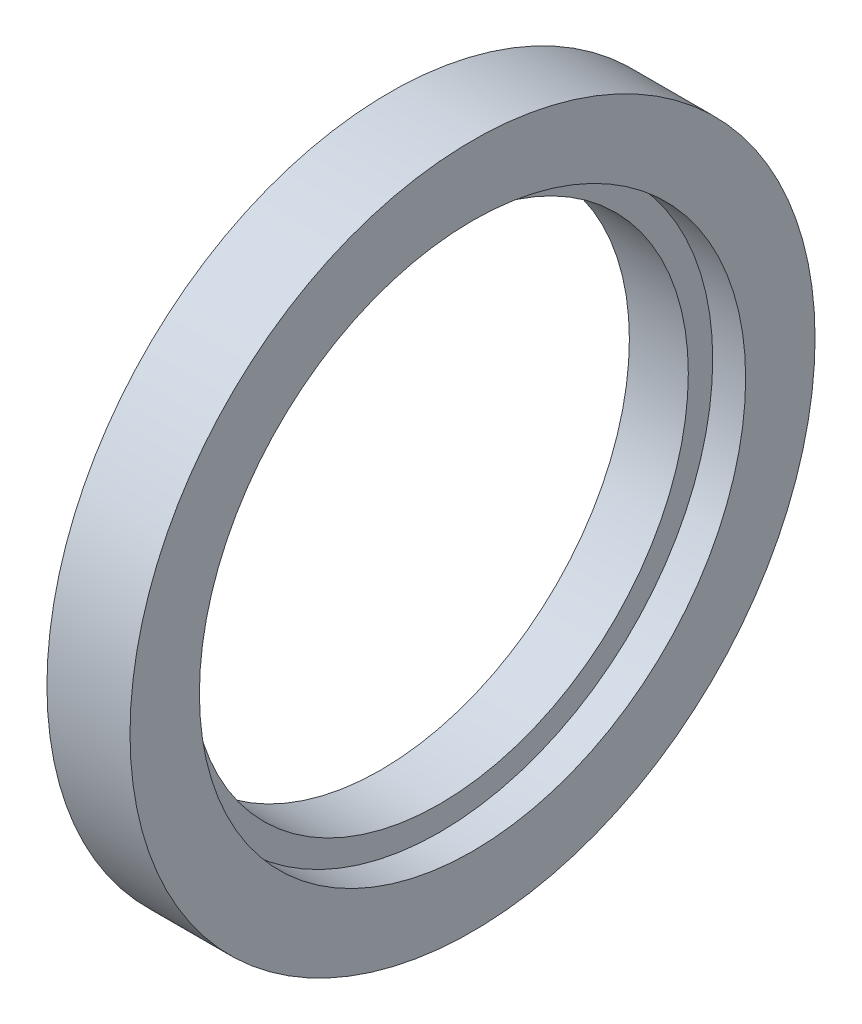
ISO-10303-21;
HEADER;
FILE_DESCRIPTION(('STEP AP214'),'2;1');
FILE_NAME('part.step','',(''),(''),'','','');
FILE_SCHEMA(('AUTOMOTIVE_DESIGN { 1 0 10303 214 1 1 1 1 }'));
ENDSEC;
DATA;
#1=APPLICATION_CONTEXT('core data for automotive mechanical design processes');
#2=APPLICATION_PROTOCOL_DEFINITION('international standard','automotive_design',2000,#1);
#3=PRODUCT_CONTEXT('',#1,'mechanical');
#4=PRODUCT('Part','Part','',(#3));
#5=PRODUCT_RELATED_PRODUCT_CATEGORY('part','',(#4));
#6=PRODUCT_DEFINITION_FORMATION('','',#4);
#7=PRODUCT_DEFINITION_CONTEXT('part definition',#1,'design');
#8=PRODUCT_DEFINITION('design','',#6,#7);
#9=PRODUCT_DEFINITION_SHAPE('','',#8);
#10=(LENGTH_UNIT() NAMED_UNIT(*) SI_UNIT(.MILLI.,.METRE.));
#11=(NAMED_UNIT(*) PLANE_ANGLE_UNIT() SI_UNIT($,.RADIAN.));
#12=(NAMED_UNIT(*) SI_UNIT($,.STERADIAN.) SOLID_ANGLE_UNIT());
#13=UNCERTAINTY_MEASURE_WITH_UNIT(LENGTH_MEASURE(1.E-05),#10,'distance_accuracy_value','');
#14=(GEOMETRIC_REPRESENTATION_CONTEXT(3) GLOBAL_UNCERTAINTY_ASSIGNED_CONTEXT((#13)) GLOBAL_UNIT_ASSIGNED_CONTEXT((#10,
#11,#12)) REPRESENTATION_CONTEXT('',''));
#15=CARTESIAN_POINT('',(0.,0.,0.));
#16=DIRECTION('',(0.,0.,1.));
#17=DIRECTION('',(1.,0.,0.));
#18=AXIS2_PLACEMENT_3D('',#15,#16,#17);
#19=CARTESIAN_POINT('',(2.0692999999999,0.,0.));
#20=DIRECTION('',(1.,0.,0.));
#21=DIRECTION('',(0.,0.,-1.));
#22=AXIS2_PLACEMENT_3D('',#19,#20,#21);
#23=CYLINDRICAL_SURFACE('',#22,17.4624999999999);
#24=CARTESIAN_POINT('',(4.13859999999983,0.,0.));
#25=DIRECTION('',(1.,0.,0.));
#26=DIRECTION('',(0.,0.,-1.));
#27=AXIS2_PLACEMENT_3D('',#24,#25,#26);
#28=CIRCLE('',#27,17.4624999999999);
#29=CARTESIAN_POINT('',(4.13859999999983,0.,-17.4624999999999));
#30=VERTEX_POINT('',#29);
#31=EDGE_CURVE('E16',#30,#30,#28,.F.);
#32=ORIENTED_EDGE('',*,*,#31,.F.);
#33=EDGE_LOOP('',(#32));
#34=FACE_BOUND('',#33,.T.);
#35=CARTESIAN_POINT('',(0.,0.,0.));
#36=DIRECTION('',(1.,0.,0.));
#37=DIRECTION('',(0.,0.,-1.));
#38=AXIS2_PLACEMENT_3D('',#35,#36,#37);
#39=CIRCLE('',#38,17.4624999999999);
#40=CARTESIAN_POINT('',(0.,0.,-17.4624999999999));
#41=VERTEX_POINT('',#40);
#42=EDGE_CURVE('E42',#41,#41,#39,.T.);
#43=ORIENTED_EDGE('',*,*,#42,.F.);
#44=EDGE_LOOP('',(#43));
#45=FACE_BOUND('',#44,.T.);
#46=ADVANCED_FACE('F13',(#34,#45),#23,.F.);
#47=CARTESIAN_POINT('',(4.13859999999983,18.3197499999999,0.));
#48=DIRECTION('',(1.,0.,0.));
#49=DIRECTION('',(0.,0.,-1.));
#50=AXIS2_PLACEMENT_3D('',#47,#48,#49);
#51=PLANE('',#50);
#52=ORIENTED_EDGE('',*,*,#31,.T.);
#53=EDGE_LOOP('',(#52));
#54=FACE_BOUND('',#53,.T.);
#55=CARTESIAN_POINT('',(4.13859999999983,0.,0.));
#56=DIRECTION('',(1.,0.,0.));
#57=DIRECTION('',(0.,0.,-1.));
#58=AXIS2_PLACEMENT_3D('',#55,#56,#57);
#59=CIRCLE('',#58,19.1769999999999);
#60=CARTESIAN_POINT('',(4.13859999999983,0.,-19.1769999999999));
#61=VERTEX_POINT('',#60);
#62=EDGE_CURVE('E40',#61,#61,#59,.T.);
#63=ORIENTED_EDGE('',*,*,#62,.T.);
#64=EDGE_LOOP('',(#63));
#65=FACE_BOUND('',#64,.T.);
#66=ADVANCED_FACE('F49',(#54,#65),#51,.T.);
#67=CARTESIAN_POINT('',(0.,19.2062500000005,0.));
#68=DIRECTION('',(-1.,0.,0.));
#69=DIRECTION('',(0.,0.,1.));
#70=AXIS2_PLACEMENT_3D('',#67,#68,#69);
#71=PLANE('',#70);
#72=ORIENTED_EDGE('',*,*,#42,.T.);
#73=EDGE_LOOP('',(#72));
#74=FACE_BOUND('',#73,.T.);
#75=CARTESIAN_POINT('',(0.,0.,0.));
#76=DIRECTION('',(1.,0.,0.));
#77=DIRECTION('',(0.,0.,-1.));
#78=AXIS2_PLACEMENT_3D('',#75,#76,#77);
#79=CIRCLE('',#78,20.950000000001);
#80=CARTESIAN_POINT('',(0.,0.,-20.950000000001));
#81=VERTEX_POINT('',#80);
#82=EDGE_CURVE('E37',#81,#81,#79,.F.);
#83=ORIENTED_EDGE('',*,*,#82,.T.);
#84=EDGE_LOOP('',(#83));
#85=FACE_BOUND('',#84,.T.);
#86=ADVANCED_FACE('F60',(#74,#85),#71,.T.);
#87=CARTESIAN_POINT('',(5.29429999999922,0.,0.));
#88=DIRECTION('',(1.,0.,0.));
#89=DIRECTION('',(0.,0.,-1.));
#90=AXIS2_PLACEMENT_3D('',#87,#88,#89);
#91=CYLINDRICAL_SURFACE('',#90,19.1769999999999);
#92=CARTESIAN_POINT('',(6.44999999999861,0.,0.));
#93=DIRECTION('',(1.,0.,0.));
#94=DIRECTION('',(0.,0.,-1.));
#95=AXIS2_PLACEMENT_3D('',#92,#93,#94);
#96=CIRCLE('',#95,19.1769999999999);
#97=CARTESIAN_POINT('',(6.44999999999861,0.,-19.1769999999999));
#98=VERTEX_POINT('',#97);
#99=EDGE_CURVE('E32',#98,#98,#96,.F.);
#100=ORIENTED_EDGE('',*,*,#99,.F.);
#101=EDGE_LOOP('',(#100));
#102=FACE_BOUND('',#101,.T.);
#103=ORIENTED_EDGE('',*,*,#62,.F.);
#104=EDGE_LOOP('',(#103));
#105=FACE_BOUND('',#104,.T.);
#106=ADVANCED_FACE('F79',(#102,#105),#91,.F.);
#107=CARTESIAN_POINT('',(-0.255000000000098,0.,0.));
#108=DIRECTION('',(1.,0.,0.));
#109=DIRECTION('',(0.,0.,-1.));
#110=AXIS2_PLACEMENT_3D('',#107,#108,#109);
#111=CYLINDRICAL_SURFACE('',#110,20.950000000001);
#112=ORIENTED_EDGE('',*,*,#82,.F.);
#113=EDGE_LOOP('',(#112));
#114=FACE_BOUND('',#113,.T.);
#115=CARTESIAN_POINT('',(-0.510000002164026,0.,0.));
#116=DIRECTION('',(1.,0.,0.));
#117=DIRECTION('',(0.,1.,0.));
#118=AXIS2_PLACEMENT_3D('',#115,#116,#117);
#119=CIRCLE('',#118,20.9500000007886);
#120=CARTESIAN_POINT('',(-0.510000002164026,20.9500000007886,0.));
#121=VERTEX_POINT('',#120);
#122=EDGE_CURVE('E25',#121,#121,#119,.T.);
#123=ORIENTED_EDGE('',*,*,#122,.F.);
#124=EDGE_LOOP('',(#123));
#125=FACE_BOUND('',#124,.T.);
#126=ADVANCED_FACE('F75',(#114,#125),#111,.F.);
#127=CARTESIAN_POINT('',(6.44999999999861,21.6135000000001,0.));
#128=DIRECTION('',(1.,0.,0.));
#129=DIRECTION('',(0.,0.,-1.));
#130=AXIS2_PLACEMENT_3D('',#127,#128,#129);
#131=PLANE('',#130);
#132=ORIENTED_EDGE('',*,*,#99,.T.);
#133=EDGE_LOOP('',(#132));
#134=FACE_BOUND('',#133,.T.);
#135=CARTESIAN_POINT('',(6.44999999999861,0.,0.));
#136=DIRECTION('',(1.,0.,0.));
#137=DIRECTION('',(0.,0.,-1.));
#138=AXIS2_PLACEMENT_3D('',#135,#136,#137);
#139=CIRCLE('',#138,24.0500000000003);
#140=CARTESIAN_POINT('',(6.44999999999861,0.,-24.0500000000003));
#141=VERTEX_POINT('',#140);
#142=EDGE_CURVE('E20',#141,#141,#139,.F.);
#143=ORIENTED_EDGE('',*,*,#142,.F.);
#144=EDGE_LOOP('',(#143));
#145=FACE_BOUND('',#144,.T.);
#146=ADVANCED_FACE('F68',(#134,#145),#131,.T.);
#147=CARTESIAN_POINT('',(0.618307728388946,0.,0.));
#148=DIRECTION('',(1.,0.,0.));
#149=DIRECTION('',(0.,0.,-1.));
#150=AXIS2_PLACEMENT_3D('',#147,#148,#149);
#151=CONICAL_SURFACE('',#150,24.0499999992128,1.22173047499991);
#152=ORIENTED_EDGE('',*,*,#122,.T.);
#153=EDGE_LOOP('',(#152));
#154=FACE_BOUND('',#153,.T.);
#155=CARTESIAN_POINT('',(0.618307726225102,0.,0.));
#156=DIRECTION('',(1.,0.,0.));
#157=DIRECTION('',(0.,0.,-1.));
#158=AXIS2_PLACEMENT_3D('',#155,#156,#157);
#159=CIRCLE('',#158,24.0500000000003);
#160=CARTESIAN_POINT('',(0.618307726225102,0.,-24.0500000000003));
#161=VERTEX_POINT('',#160);
#162=EDGE_CURVE('E9',#161,#161,#159,.T.);
#163=ORIENTED_EDGE('',*,*,#162,.F.);
#164=EDGE_LOOP('',(#163));
#165=FACE_BOUND('',#164,.T.);
#166=ADVANCED_FACE('F62',(#154,#165),#151,.T.);
#167=CARTESIAN_POINT('',(3.53415386311184,0.,0.));
#168=DIRECTION('',(1.,0.,0.));
#169=DIRECTION('',(0.,0.,-1.));
#170=AXIS2_PLACEMENT_3D('',#167,#168,#169);
#171=CYLINDRICAL_SURFACE('',#170,24.0500000000003);
#172=ORIENTED_EDGE('',*,*,#162,.T.);
#173=EDGE_LOOP('',(#172));
#174=FACE_BOUND('',#173,.T.);
#175=ORIENTED_EDGE('',*,*,#142,.T.);
#176=EDGE_LOOP('',(#175));
#177=FACE_BOUND('',#176,.T.);
#178=ADVANCED_FACE('F61',(#174,#177),#171,.T.);
#179=CLOSED_SHELL('',(#46,#66,#86,#106,#126,#146,#166,#178));
#180=MANIFOLD_SOLID_BREP('B1',#179);
#181=ADVANCED_BREP_SHAPE_REPRESENTATION('',(#18,#180),#14);
#182=SHAPE_DEFINITION_REPRESENTATION(#9,#181);
ENDSEC;
END-ISO-10303-21;
